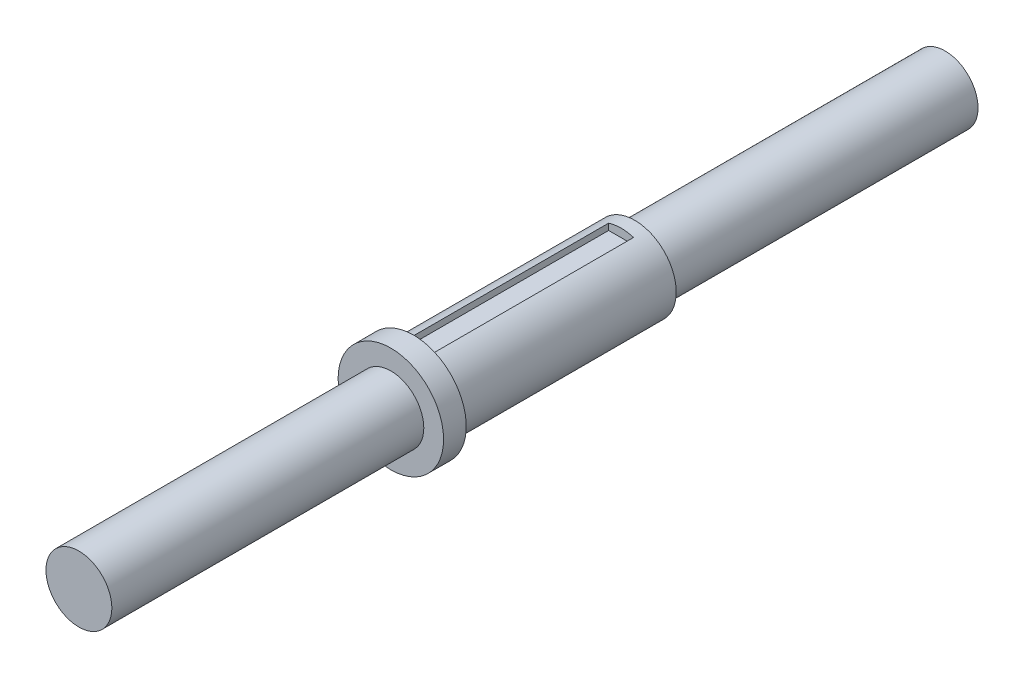
ISO-10303-21;
HEADER;
FILE_DESCRIPTION(('STEP AP214'),'2;1');
FILE_NAME('part.step','',(''),(''),'','','');
FILE_SCHEMA(('AUTOMOTIVE_DESIGN { 1 0 10303 214 1 1 1 1 }'));
ENDSEC;
DATA;
#1=APPLICATION_CONTEXT('core data for automotive mechanical design processes');
#2=APPLICATION_PROTOCOL_DEFINITION('international standard','automotive_design',2000,#1);
#3=PRODUCT_CONTEXT('',#1,'mechanical');
#4=PRODUCT('Part','Part','',(#3));
#5=PRODUCT_RELATED_PRODUCT_CATEGORY('part','',(#4));
#6=PRODUCT_DEFINITION_FORMATION('','',#4);
#7=PRODUCT_DEFINITION_CONTEXT('part definition',#1,'design');
#8=PRODUCT_DEFINITION('design','',#6,#7);
#9=PRODUCT_DEFINITION_SHAPE('','',#8);
#10=(LENGTH_UNIT() NAMED_UNIT(*) SI_UNIT(.MILLI.,.METRE.));
#11=(NAMED_UNIT(*) PLANE_ANGLE_UNIT() SI_UNIT($,.RADIAN.));
#12=(NAMED_UNIT(*) SI_UNIT($,.STERADIAN.) SOLID_ANGLE_UNIT());
#13=UNCERTAINTY_MEASURE_WITH_UNIT(LENGTH_MEASURE(1.E-05),#10,'distance_accuracy_value','');
#14=(GEOMETRIC_REPRESENTATION_CONTEXT(3) GLOBAL_UNCERTAINTY_ASSIGNED_CONTEXT((#13)) GLOBAL_UNIT_ASSIGNED_CONTEXT((#10,
#11,#12)) REPRESENTATION_CONTEXT('',''));
#15=CARTESIAN_POINT('',(0.,0.,0.));
#16=DIRECTION('',(0.,0.,1.));
#17=DIRECTION('',(1.,0.,0.));
#18=AXIS2_PLACEMENT_3D('',#15,#16,#17);
#19=CARTESIAN_POINT('',(0.,0.,93.36));
#20=DIRECTION('',(0.,0.,-1.));
#21=DIRECTION('',(-1.,0.,0.));
#22=AXIS2_PLACEMENT_3D('',#19,#20,#21);
#23=CYLINDRICAL_SURFACE('',#22,3.97);
#24=CARTESIAN_POINT('',(0.,0.,93.36));
#25=DIRECTION('',(0.,0.,-1.));
#26=DIRECTION('',(-1.,0.,0.));
#27=AXIS2_PLACEMENT_3D('',#24,#25,#26);
#28=CIRCLE('',#27,3.97);
#29=CARTESIAN_POINT('',(-3.97,0.,93.36));
#30=VERTEX_POINT('',#29);
#31=EDGE_CURVE('E185',#30,#30,#28,.T.);
#32=ORIENTED_EDGE('',*,*,#31,.T.);
#33=EDGE_LOOP('',(#32));
#34=FACE_BOUND('',#33,.T.);
#35=CARTESIAN_POINT('',(0.,0.,55.98));
#36=DIRECTION('',(0.,0.,-1.));
#37=DIRECTION('',(-1.,0.,0.));
#38=AXIS2_PLACEMENT_3D('',#35,#36,#37);
#39=CIRCLE('',#38,3.97);
#40=CARTESIAN_POINT('',(-3.97,0.,55.98));
#41=VERTEX_POINT('',#40);
#42=EDGE_CURVE('E40',#41,#41,#39,.F.);
#43=ORIENTED_EDGE('',*,*,#42,.T.);
#44=EDGE_LOOP('',(#43));
#45=FACE_BOUND('',#44,.T.);
#46=ADVANCED_FACE('F36',(#34,#45),#23,.T.);
#47=CARTESIAN_POINT('',(0.,0.,120.));
#48=DIRECTION('',(0.,0.,-1.));
#49=DIRECTION('',(-1.,0.,0.));
#50=AXIS2_PLACEMENT_3D('',#47,#48,#49);
#51=CYLINDRICAL_SURFACE('',#50,5.);
#52=DIRECTION('',(0.,0.,-1.));
#53=VECTOR('',#52,1.);
#54=CARTESIAN_POINT('',(-1.88367716829418,-4.63160450876877,120.));
#55=LINE('',#54,#53);
#56=CARTESIAN_POINT('',(-1.88367716829418,-4.63160450876877,120.));
#57=VERTEX_POINT('',#56);
#58=CARTESIAN_POINT('',(-1.88367716829418,-4.63160450876877,95.0203438734206));
#59=VERTEX_POINT('',#58);
#60=EDGE_CURVE('E122',#57,#59,#55,.T.);
#61=ORIENTED_EDGE('',*,*,#60,.F.);
#62=CARTESIAN_POINT('',(0.,0.,120.));
#63=DIRECTION('',(0.,0.,-1.));
#64=DIRECTION('',(-1.,0.,0.));
#65=AXIS2_PLACEMENT_3D('',#62,#63,#64);
#66=CIRCLE('',#65,5.);
#67=CARTESIAN_POINT('',(-1.5,4.76969600708473,120.));
#68=VERTEX_POINT('',#67);
#69=EDGE_CURVE('E200',#57,#68,#66,.T.);
#70=ORIENTED_EDGE('',*,*,#69,.T.);
#71=DIRECTION('',(0.,0.,-1.));
#72=VECTOR('',#71,1.);
#73=CARTESIAN_POINT('',(-1.5,4.76969600708473,120.));
#74=LINE('',#73,#72);
#75=CARTESIAN_POINT('',(-1.5,4.76969600708473,95.0000000000001));
#76=VERTEX_POINT('',#75);
#77=EDGE_CURVE('E182',#76,#68,#74,.F.);
#78=ORIENTED_EDGE('',*,*,#77,.F.);
#79=CARTESIAN_POINT('',(0.,0.,95.0000000000001));
#80=DIRECTION('',(0.,0.,-1.));
#81=DIRECTION('',(-1.,0.,0.));
#82=AXIS2_PLACEMENT_3D('',#79,#80,#81);
#83=CIRCLE('',#82,5.);
#84=CARTESIAN_POINT('',(1.5,4.76969600708473,95.0000000000001));
#85=VERTEX_POINT('',#84);
#86=EDGE_CURVE('E203',#85,#76,#83,.F.);
#87=ORIENTED_EDGE('',*,*,#86,.F.);
#88=DIRECTION('',(0.,0.,-1.));
#89=VECTOR('',#88,1.);
#90=CARTESIAN_POINT('',(1.5,4.76969600708473,120.));
#91=LINE('',#90,#89);
#92=CARTESIAN_POINT('',(1.5,4.76969600708473,120.));
#93=VERTEX_POINT('',#92);
#94=EDGE_CURVE('E173',#93,#85,#91,.T.);
#95=ORIENTED_EDGE('',*,*,#94,.F.);
#96=CARTESIAN_POINT('',(1.88367716829418,-4.63160450876877,120.));
#97=VERTEX_POINT('',#96);
#98=EDGE_CURVE('E196',#93,#97,#66,.T.);
#99=ORIENTED_EDGE('',*,*,#98,.T.);
#100=DIRECTION('',(0.,0.,-1.));
#101=VECTOR('',#100,1.);
#102=CARTESIAN_POINT('',(1.88367716829418,-4.63160450876877,120.));
#103=LINE('',#102,#101);
#104=CARTESIAN_POINT('',(1.88367716829418,-4.63160450876877,95.0203438734206));
#105=VERTEX_POINT('',#104);
#106=EDGE_CURVE('E151',#105,#97,#103,.F.);
#107=ORIENTED_EDGE('',*,*,#106,.F.);
#108=CARTESIAN_POINT('',(0.,0.,95.0203438734206));
#109=DIRECTION('',(0.,0.,-1.));
#110=DIRECTION('',(-1.,0.,0.));
#111=AXIS2_PLACEMENT_3D('',#108,#109,#110);
#112=CIRCLE('',#111,5.);
#113=EDGE_CURVE('E12',#59,#105,#112,.F.);
#114=ORIENTED_EDGE('',*,*,#113,.F.);
#115=EDGE_LOOP('',(#61,#70,#78,#87,#95,#99,#107,#114));
#116=FACE_BOUND('',#115,.T.);
#117=CARTESIAN_POINT('',(0.,0.,93.36));
#118=DIRECTION('',(0.,0.,-1.));
#119=DIRECTION('',(-1.,0.,0.));
#120=AXIS2_PLACEMENT_3D('',#117,#118,#119);
#121=CIRCLE('',#120,5.);
#122=CARTESIAN_POINT('',(-5.,0.,93.36));
#123=VERTEX_POINT('',#122);
#124=EDGE_CURVE('E188',#123,#123,#121,.F.);
#125=ORIENTED_EDGE('',*,*,#124,.T.);
#126=EDGE_LOOP('',(#125));
#127=FACE_BOUND('',#126,.T.);
#128=ADVANCED_FACE('F219',(#116,#127),#51,.T.);
#129=CARTESIAN_POINT('',(0.,0.,160.3));
#130=DIRECTION('',(0.,0.,-1.));
#131=DIRECTION('',(-1.,0.,0.));
#132=AXIS2_PLACEMENT_3D('',#129,#130,#131);
#133=CYLINDRICAL_SURFACE('',#132,6.35);
#134=CARTESIAN_POINT('',(0.,0.,120.));
#135=DIRECTION('',(0.,0.,-1.));
#136=DIRECTION('',(-1.,0.,0.));
#137=AXIS2_PLACEMENT_3D('',#134,#135,#136);
#138=CIRCLE('',#137,6.35);
#139=CARTESIAN_POINT('',(-6.35,0.,120.));
#140=VERTEX_POINT('',#139);
#141=EDGE_CURVE('E199',#140,#140,#138,.T.);
#142=ORIENTED_EDGE('',*,*,#141,.F.);
#143=EDGE_LOOP('',(#142));
#144=FACE_BOUND('',#143,.T.);
#145=CARTESIAN_POINT('',(0.,0.,122.73));
#146=DIRECTION('',(0.,0.,1.));
#147=DIRECTION('',(1.,0.,0.));
#148=AXIS2_PLACEMENT_3D('',#145,#146,#147);
#149=CIRCLE('',#148,6.35);
#150=CARTESIAN_POINT('',(6.35,0.,122.73));
#151=VERTEX_POINT('',#150);
#152=EDGE_CURVE('E192',#151,#151,#149,.T.);
#153=ORIENTED_EDGE('',*,*,#152,.F.);
#154=EDGE_LOOP('',(#153));
#155=FACE_BOUND('',#154,.T.);
#156=ADVANCED_FACE('F38',(#144,#155),#133,.T.);
#157=CARTESIAN_POINT('',(0.,0.,120.));
#158=DIRECTION('',(0.,0.,-1.));
#159=DIRECTION('',(-1.,0.,0.));
#160=AXIS2_PLACEMENT_3D('',#157,#158,#159);
#161=PLANE('',#160);
#162=DIRECTION('',(0.,1.,0.));
#163=VECTOR('',#162,1.);
#164=CARTESIAN_POINT('',(-1.88367716829418,0.,120.));
#165=LINE('',#164,#163);
#166=CARTESIAN_POINT('',(-1.88367716829418,-5.,120.));
#167=VERTEX_POINT('',#166);
#168=EDGE_CURVE('E45',#167,#57,#165,.T.);
#169=ORIENTED_EDGE('',*,*,#168,.F.);
#170=DIRECTION('',(1.,0.,0.));
#171=VECTOR('',#170,1.);
#172=CARTESIAN_POINT('',(0.,-5.,120.));
#173=LINE('',#172,#171);
#174=CARTESIAN_POINT('',(1.88367716829418,-5.,120.));
#175=VERTEX_POINT('',#174);
#176=EDGE_CURVE('E209',#167,#175,#173,.T.);
#177=ORIENTED_EDGE('',*,*,#176,.T.);
#178=DIRECTION('',(0.,-1.,0.));
#179=VECTOR('',#178,1.);
#180=CARTESIAN_POINT('',(1.88367716829418,0.,120.));
#181=LINE('',#180,#179);
#182=EDGE_CURVE('E212',#97,#175,#181,.T.);
#183=ORIENTED_EDGE('',*,*,#182,.F.);
#184=ORIENTED_EDGE('',*,*,#98,.F.);
#185=DIRECTION('',(0.,1.,0.));
#186=VECTOR('',#185,1.);
#187=CARTESIAN_POINT('',(1.5,4.,120.));
#188=LINE('',#187,#186);
#189=CARTESIAN_POINT('',(1.5,4.,120.));
#190=VERTEX_POINT('',#189);
#191=EDGE_CURVE('E60',#190,#93,#188,.T.);
#192=ORIENTED_EDGE('',*,*,#191,.F.);
#193=DIRECTION('',(1.,0.,0.));
#194=VECTOR('',#193,1.);
#195=CARTESIAN_POINT('',(1.5,4.,120.));
#196=LINE('',#195,#194);
#197=CARTESIAN_POINT('',(-1.5,4.,120.));
#198=VERTEX_POINT('',#197);
#199=EDGE_CURVE('E158',#198,#190,#196,.T.);
#200=ORIENTED_EDGE('',*,*,#199,.F.);
#201=DIRECTION('',(0.,1.,0.));
#202=VECTOR('',#201,1.);
#203=CARTESIAN_POINT('',(-1.5,4.,120.));
#204=LINE('',#203,#202);
#205=EDGE_CURVE('E170',#198,#68,#204,.T.);
#206=ORIENTED_EDGE('',*,*,#205,.T.);
#207=ORIENTED_EDGE('',*,*,#69,.F.);
#208=EDGE_LOOP('',(#169,#177,#183,#184,#192,#200,#206,#207));
#209=FACE_BOUND('',#208,.T.);
#210=ORIENTED_EDGE('',*,*,#141,.T.);
#211=EDGE_LOOP('',(#210));
#212=FACE_BOUND('',#211,.T.);
#213=ADVANCED_FACE('F223',(#209,#212),#161,.T.);
#214=CARTESIAN_POINT('',(0.,0.,122.73));
#215=DIRECTION('',(0.,0.,1.));
#216=DIRECTION('',(1.,0.,0.));
#217=AXIS2_PLACEMENT_3D('',#214,#215,#216);
#218=PLANE('',#217);
#219=CARTESIAN_POINT('',(0.,0.,122.73));
#220=DIRECTION('',(0.,0.,1.));
#221=DIRECTION('',(1.,0.,0.));
#222=AXIS2_PLACEMENT_3D('',#219,#220,#221);
#223=CIRCLE('',#222,3.96875);
#224=CARTESIAN_POINT('',(3.96875,0.,122.73));
#225=VERTEX_POINT('',#224);
#226=EDGE_CURVE('E189',#225,#225,#223,.T.);
#227=ORIENTED_EDGE('',*,*,#226,.F.);
#228=EDGE_LOOP('',(#227));
#229=FACE_BOUND('',#228,.T.);
#230=ORIENTED_EDGE('',*,*,#152,.T.);
#231=EDGE_LOOP('',(#230));
#232=FACE_BOUND('',#231,.T.);
#233=ADVANCED_FACE('F264',(#229,#232),#218,.T.);
#234=CARTESIAN_POINT('',(0.,0.,122.73));
#235=DIRECTION('',(0.,0.,1.));
#236=DIRECTION('',(1.,0.,0.));
#237=AXIS2_PLACEMENT_3D('',#234,#235,#236);
#238=CYLINDRICAL_SURFACE('',#237,3.96875);
#239=ORIENTED_EDGE('',*,*,#226,.T.);
#240=EDGE_LOOP('',(#239));
#241=FACE_BOUND('',#240,.T.);
#242=CARTESIAN_POINT('',(0.,0.,160.3));
#243=DIRECTION('',(0.,0.,1.));
#244=DIRECTION('',(1.,0.,0.));
#245=AXIS2_PLACEMENT_3D('',#242,#243,#244);
#246=CIRCLE('',#245,3.96875);
#247=CARTESIAN_POINT('',(3.96875,0.,160.3));
#248=VERTEX_POINT('',#247);
#249=EDGE_CURVE('E193',#248,#248,#246,.T.);
#250=ORIENTED_EDGE('',*,*,#249,.F.);
#251=EDGE_LOOP('',(#250));
#252=FACE_BOUND('',#251,.T.);
#253=ADVANCED_FACE('F261',(#241,#252),#238,.T.);
#254=CARTESIAN_POINT('',(0.,0.,160.3));
#255=DIRECTION('',(0.,0.,1.));
#256=DIRECTION('',(1.,0.,0.));
#257=AXIS2_PLACEMENT_3D('',#254,#255,#256);
#258=PLANE('',#257);
#259=ORIENTED_EDGE('',*,*,#249,.T.);
#260=EDGE_LOOP('',(#259));
#261=FACE_BOUND('',#260,.T.);
#262=ADVANCED_FACE('F259',(#261),#258,.T.);
#263=CARTESIAN_POINT('',(0.,0.,93.36));
#264=DIRECTION('',(0.,0.,-1.));
#265=DIRECTION('',(-1.,0.,0.));
#266=AXIS2_PLACEMENT_3D('',#263,#264,#265);
#267=PLANE('',#266);
#268=ORIENTED_EDGE('',*,*,#124,.F.);
#269=EDGE_LOOP('',(#268));
#270=FACE_BOUND('',#269,.T.);
#271=ORIENTED_EDGE('',*,*,#31,.F.);
#272=EDGE_LOOP('',(#271));
#273=FACE_BOUND('',#272,.T.);
#274=ADVANCED_FACE('F256',(#270,#273),#267,.T.);
#275=CARTESIAN_POINT('',(-1.5,4.,95.0000000000001));
#276=DIRECTION('',(-1.,0.,0.));
#277=DIRECTION('',(0.,0.,1.));
#278=AXIS2_PLACEMENT_3D('',#275,#276,#277);
#279=PLANE('',#278);
#280=ORIENTED_EDGE('',*,*,#77,.T.);
#281=ORIENTED_EDGE('',*,*,#205,.F.);
#282=DIRECTION('',(0.,0.,1.));
#283=VECTOR('',#282,1.);
#284=CARTESIAN_POINT('',(-1.5,4.,95.0000000000001));
#285=LINE('',#284,#283);
#286=CARTESIAN_POINT('',(-1.5,4.,95.0000000000001));
#287=VERTEX_POINT('',#286);
#288=EDGE_CURVE('E167',#287,#198,#285,.T.);
#289=ORIENTED_EDGE('',*,*,#288,.F.);
#290=DIRECTION('',(0.,1.,0.));
#291=VECTOR('',#290,1.);
#292=CARTESIAN_POINT('',(-1.5,4.,95.0000000000001));
#293=LINE('',#292,#291);
#294=EDGE_CURVE('E174',#287,#76,#293,.T.);
#295=ORIENTED_EDGE('',*,*,#294,.T.);
#296=EDGE_LOOP('',(#280,#281,#289,#295));
#297=FACE_BOUND('',#296,.T.);
#298=ADVANCED_FACE('F228',(#297),#279,.F.);
#299=CARTESIAN_POINT('',(1.5,4.,95.0000000000001));
#300=DIRECTION('',(0.,0.,-1.));
#301=DIRECTION('',(-1.,0.,0.));
#302=AXIS2_PLACEMENT_3D('',#299,#300,#301);
#303=PLANE('',#302);
#304=DIRECTION('',(0.,1.,0.));
#305=VECTOR('',#304,1.);
#306=CARTESIAN_POINT('',(1.5,4.,95.0000000000001));
#307=LINE('',#306,#305);
#308=CARTESIAN_POINT('',(1.5,4.,95.0000000000001));
#309=VERTEX_POINT('',#308);
#310=EDGE_CURVE('E177',#309,#85,#307,.T.);
#311=ORIENTED_EDGE('',*,*,#310,.T.);
#312=ORIENTED_EDGE('',*,*,#86,.T.);
#313=ORIENTED_EDGE('',*,*,#294,.F.);
#314=DIRECTION('',(-1.,0.,0.));
#315=VECTOR('',#314,1.);
#316=CARTESIAN_POINT('',(1.5,4.,95.0000000000001));
#317=LINE('',#316,#315);
#318=EDGE_CURVE('E164',#309,#287,#317,.T.);
#319=ORIENTED_EDGE('',*,*,#318,.F.);
#320=EDGE_LOOP('',(#311,#312,#313,#319));
#321=FACE_BOUND('',#320,.T.);
#322=ADVANCED_FACE('F233',(#321),#303,.F.);
#323=CARTESIAN_POINT('',(1.5,4.,120.));
#324=DIRECTION('',(1.,0.,0.));
#325=DIRECTION('',(0.,0.,-1.));
#326=AXIS2_PLACEMENT_3D('',#323,#324,#325);
#327=PLANE('',#326);
#328=ORIENTED_EDGE('',*,*,#94,.T.);
#329=ORIENTED_EDGE('',*,*,#310,.F.);
#330=DIRECTION('',(0.,0.,-1.));
#331=VECTOR('',#330,1.);
#332=CARTESIAN_POINT('',(1.5,4.,120.));
#333=LINE('',#332,#331);
#334=EDGE_CURVE('E161',#190,#309,#333,.T.);
#335=ORIENTED_EDGE('',*,*,#334,.F.);
#336=ORIENTED_EDGE('',*,*,#191,.T.);
#337=EDGE_LOOP('',(#328,#329,#335,#336));
#338=FACE_BOUND('',#337,.T.);
#339=ADVANCED_FACE('F231',(#338),#327,.F.);
#340=CARTESIAN_POINT('',(0.,4.,0.));
#341=DIRECTION('',(0.,1.,0.));
#342=DIRECTION('',(0.,0.,1.));
#343=AXIS2_PLACEMENT_3D('',#340,#341,#342);
#344=PLANE('',#343);
#345=ORIENTED_EDGE('',*,*,#199,.T.);
#346=ORIENTED_EDGE('',*,*,#334,.T.);
#347=ORIENTED_EDGE('',*,*,#318,.T.);
#348=ORIENTED_EDGE('',*,*,#288,.T.);
#349=EDGE_LOOP('',(#345,#346,#347,#348));
#350=FACE_BOUND('',#349,.T.);
#351=ADVANCED_FACE('F235',(#350),#344,.T.);
#352=CARTESIAN_POINT('',(-1.88367716829418,-4.,95.0203438734206));
#353=DIRECTION('',(-1.,0.,0.));
#354=DIRECTION('',(0.,0.,1.));
#355=AXIS2_PLACEMENT_3D('',#352,#353,#354);
#356=PLANE('',#355);
#357=ORIENTED_EDGE('',*,*,#60,.T.);
#358=DIRECTION('',(0.,-1.,0.));
#359=VECTOR('',#358,1.);
#360=CARTESIAN_POINT('',(-1.88367716829418,-4.,95.0203438734206));
#361=LINE('',#360,#359);
#362=CARTESIAN_POINT('',(-1.88367716829418,-4.,95.0203438734206));
#363=VERTEX_POINT('',#362);
#364=EDGE_CURVE('E115',#363,#59,#361,.T.);
#365=ORIENTED_EDGE('',*,*,#364,.F.);
#366=DIRECTION('',(0.,0.,-1.));
#367=VECTOR('',#366,1.);
#368=CARTESIAN_POINT('',(-1.88367716829418,-4.,95.0203438734206));
#369=LINE('',#368,#367);
#370=CARTESIAN_POINT('',(-1.88367716829418,-4.,120.020343873421));
#371=VERTEX_POINT('',#370);
#372=EDGE_CURVE('E119',#371,#363,#369,.T.);
#373=ORIENTED_EDGE('',*,*,#372,.F.);
#374=DIRECTION('',(0.,-1.,0.));
#375=VECTOR('',#374,1.);
#376=CARTESIAN_POINT('',(-1.88367716829418,-4.,120.020343873421));
#377=LINE('',#376,#375);
#378=CARTESIAN_POINT('',(-1.88367716829418,-5.,120.020343873421));
#379=VERTEX_POINT('',#378);
#380=EDGE_CURVE('E149',#371,#379,#377,.T.);
#381=ORIENTED_EDGE('',*,*,#380,.T.);
#382=DIRECTION('',(0.,0.,-1.));
#383=VECTOR('',#382,1.);
#384=CARTESIAN_POINT('',(-1.88367716829418,-5.,95.0203438734206));
#385=LINE('',#384,#383);
#386=EDGE_CURVE('E145',#379,#167,#385,.T.);
#387=ORIENTED_EDGE('',*,*,#386,.T.);
#388=ORIENTED_EDGE('',*,*,#168,.T.);
#389=EDGE_LOOP('',(#357,#365,#373,#381,#387,#388));
#390=FACE_BOUND('',#389,.T.);
#391=ADVANCED_FACE('F117',(#390),#356,.F.);
#392=CARTESIAN_POINT('',(-1.88367716829418,-4.,120.020343873421));
#393=DIRECTION('',(0.,0.,1.));
#394=DIRECTION('',(1.,0.,0.));
#395=AXIS2_PLACEMENT_3D('',#392,#393,#394);
#396=PLANE('',#395);
#397=DIRECTION('',(-1.,0.,0.));
#398=VECTOR('',#397,1.);
#399=CARTESIAN_POINT('',(-1.88367716829418,-5.,120.020343873421));
#400=LINE('',#399,#398);
#401=CARTESIAN_POINT('',(1.88367716829418,-5.,120.020343873421));
#402=VERTEX_POINT('',#401);
#403=EDGE_CURVE('E138',#402,#379,#400,.T.);
#404=ORIENTED_EDGE('',*,*,#403,.T.);
#405=ORIENTED_EDGE('',*,*,#380,.F.);
#406=DIRECTION('',(-1.,0.,0.));
#407=VECTOR('',#406,1.);
#408=CARTESIAN_POINT('',(-1.88367716829418,-4.,120.020343873421));
#409=LINE('',#408,#407);
#410=CARTESIAN_POINT('',(1.88367716829418,-4.,120.020343873421));
#411=VERTEX_POINT('',#410);
#412=EDGE_CURVE('E125',#411,#371,#409,.T.);
#413=ORIENTED_EDGE('',*,*,#412,.F.);
#414=DIRECTION('',(0.,-1.,0.));
#415=VECTOR('',#414,1.);
#416=CARTESIAN_POINT('',(1.88367716829418,-4.,120.020343873421));
#417=LINE('',#416,#415);
#418=EDGE_CURVE('E152',#411,#402,#417,.T.);
#419=ORIENTED_EDGE('',*,*,#418,.T.);
#420=EDGE_LOOP('',(#404,#405,#413,#419));
#421=FACE_BOUND('',#420,.T.);
#422=ADVANCED_FACE('F242',(#421),#396,.F.);
#423=CARTESIAN_POINT('',(1.88367716829418,-4.,120.020343873421));
#424=DIRECTION('',(1.,0.,0.));
#425=DIRECTION('',(0.,0.,-1.));
#426=AXIS2_PLACEMENT_3D('',#423,#424,#425);
#427=PLANE('',#426);
#428=ORIENTED_EDGE('',*,*,#106,.T.);
#429=ORIENTED_EDGE('',*,*,#182,.T.);
#430=DIRECTION('',(0.,0.,1.));
#431=VECTOR('',#430,1.);
#432=CARTESIAN_POINT('',(1.88367716829418,-5.,120.020343873421));
#433=LINE('',#432,#431);
#434=EDGE_CURVE('E52',#175,#402,#433,.T.);
#435=ORIENTED_EDGE('',*,*,#434,.T.);
#436=ORIENTED_EDGE('',*,*,#418,.F.);
#437=DIRECTION('',(0.,0.,1.));
#438=VECTOR('',#437,1.);
#439=CARTESIAN_POINT('',(1.88367716829418,-4.,120.020343873421));
#440=LINE('',#439,#438);
#441=CARTESIAN_POINT('',(1.88367716829418,-4.,95.0203438734206));
#442=VERTEX_POINT('',#441);
#443=EDGE_CURVE('E134',#442,#411,#440,.T.);
#444=ORIENTED_EDGE('',*,*,#443,.F.);
#445=DIRECTION('',(0.,-1.,0.));
#446=VECTOR('',#445,1.);
#447=CARTESIAN_POINT('',(1.88367716829418,-4.,95.0203438734206));
#448=LINE('',#447,#446);
#449=EDGE_CURVE('E124',#442,#105,#448,.T.);
#450=ORIENTED_EDGE('',*,*,#449,.T.);
#451=EDGE_LOOP('',(#428,#429,#435,#436,#444,#450));
#452=FACE_BOUND('',#451,.T.);
#453=ADVANCED_FACE('F330',(#452),#427,.F.);
#454=CARTESIAN_POINT('',(1.88367716829418,-4.,95.0203438734206));
#455=DIRECTION('',(0.,0.,-1.));
#456=DIRECTION('',(-1.,0.,0.));
#457=AXIS2_PLACEMENT_3D('',#454,#455,#456);
#458=PLANE('',#457);
#459=ORIENTED_EDGE('',*,*,#364,.T.);
#460=ORIENTED_EDGE('',*,*,#113,.T.);
#461=ORIENTED_EDGE('',*,*,#449,.F.);
#462=DIRECTION('',(1.,0.,0.));
#463=VECTOR('',#462,1.);
#464=CARTESIAN_POINT('',(1.88367716829418,-4.,95.0203438734206));
#465=LINE('',#464,#463);
#466=EDGE_CURVE('E128',#363,#442,#465,.T.);
#467=ORIENTED_EDGE('',*,*,#466,.F.);
#468=EDGE_LOOP('',(#459,#460,#461,#467));
#469=FACE_BOUND('',#468,.T.);
#470=ADVANCED_FACE('F129',(#469),#458,.F.);
#471=CARTESIAN_POINT('',(0.,-4.,0.));
#472=DIRECTION('',(0.,1.,0.));
#473=DIRECTION('',(0.,0.,1.));
#474=AXIS2_PLACEMENT_3D('',#471,#472,#473);
#475=PLANE('',#474);
#476=ORIENTED_EDGE('',*,*,#372,.T.);
#477=ORIENTED_EDGE('',*,*,#466,.T.);
#478=ORIENTED_EDGE('',*,*,#443,.T.);
#479=ORIENTED_EDGE('',*,*,#412,.T.);
#480=EDGE_LOOP('',(#476,#477,#478,#479));
#481=FACE_BOUND('',#480,.T.);
#482=ADVANCED_FACE('F136',(#481),#475,.F.);
#483=CARTESIAN_POINT('',(0.,-5.,0.));
#484=DIRECTION('',(0.,1.,0.));
#485=DIRECTION('',(0.,0.,1.));
#486=AXIS2_PLACEMENT_3D('',#483,#484,#485);
#487=PLANE('',#486);
#488=ORIENTED_EDGE('',*,*,#386,.F.);
#489=ORIENTED_EDGE('',*,*,#403,.F.);
#490=ORIENTED_EDGE('',*,*,#434,.F.);
#491=ORIENTED_EDGE('',*,*,#176,.F.);
#492=EDGE_LOOP('',(#488,#489,#490,#491));
#493=FACE_BOUND('',#492,.T.);
#494=ADVANCED_FACE('F357',(#493),#487,.T.);
#495=CARTESIAN_POINT('',(0.,0.,55.98));
#496=DIRECTION('',(0.,0.,-1.));
#497=DIRECTION('',(-1.,0.,0.));
#498=AXIS2_PLACEMENT_3D('',#495,#496,#497);
#499=PLANE('',#498);
#500=ORIENTED_EDGE('',*,*,#42,.F.);
#501=EDGE_LOOP('',(#500));
#502=FACE_BOUND('',#501,.T.);
#503=ADVANCED_FACE('F365',(#502),#499,.T.);
#504=CLOSED_SHELL('',(#46,#128,#156,#213,#233,#253,#262,#274,#298,#322,#339,#351,#391,#422,#453,
#470,#482,#494,#503));
#505=MANIFOLD_SOLID_BREP('B2',#504);
#506=ADVANCED_BREP_SHAPE_REPRESENTATION('',(#18,#505),#14);
#507=SHAPE_DEFINITION_REPRESENTATION(#9,#506);
ENDSEC;
END-ISO-10303-21;
